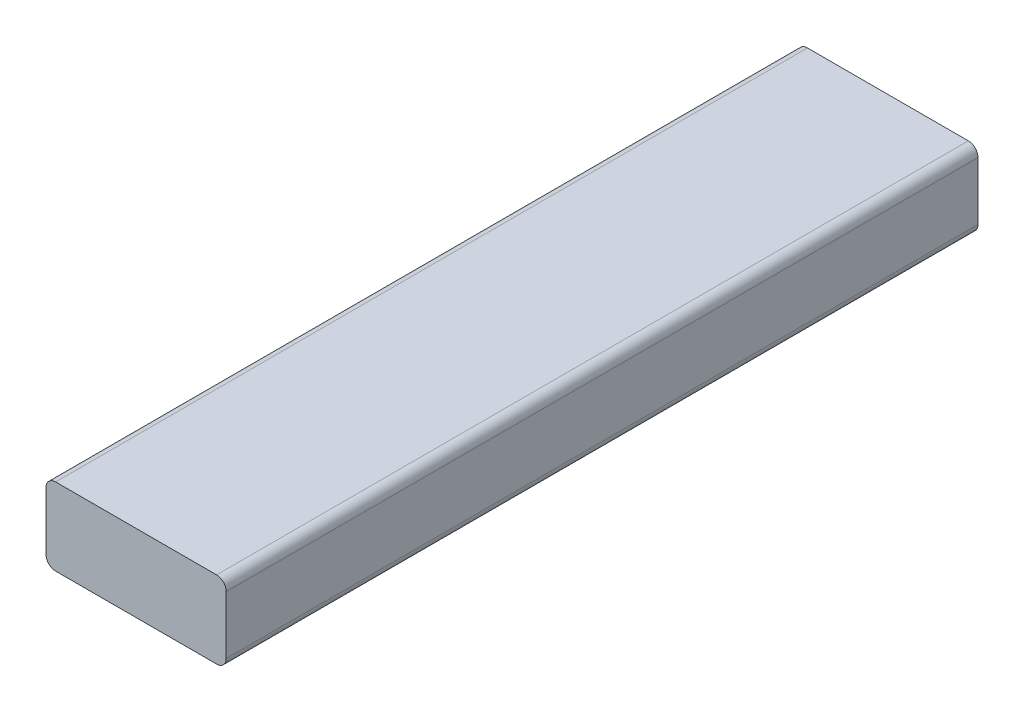
ISO-10303-21;
HEADER;
FILE_DESCRIPTION(('STEP AP214'),'2;1');
FILE_NAME('part.step','',(''),(''),'','','');
FILE_SCHEMA(('AUTOMOTIVE_DESIGN { 1 0 10303 214 1 1 1 1 }'));
ENDSEC;
DATA;
#1=APPLICATION_CONTEXT('core data for automotive mechanical design processes');
#2=APPLICATION_PROTOCOL_DEFINITION('international standard','automotive_design',2000,#1);
#3=PRODUCT_CONTEXT('',#1,'mechanical');
#4=PRODUCT('Part','Part','',(#3));
#5=PRODUCT_RELATED_PRODUCT_CATEGORY('part','',(#4));
#6=PRODUCT_DEFINITION_FORMATION('','',#4);
#7=PRODUCT_DEFINITION_CONTEXT('part definition',#1,'design');
#8=PRODUCT_DEFINITION('design','',#6,#7);
#9=PRODUCT_DEFINITION_SHAPE('','',#8);
#10=(LENGTH_UNIT() NAMED_UNIT(*) SI_UNIT(.MILLI.,.METRE.));
#11=(NAMED_UNIT(*) PLANE_ANGLE_UNIT() SI_UNIT($,.RADIAN.));
#12=(NAMED_UNIT(*) SI_UNIT($,.STERADIAN.) SOLID_ANGLE_UNIT());
#13=UNCERTAINTY_MEASURE_WITH_UNIT(LENGTH_MEASURE(1.E-05),#10,'distance_accuracy_value','');
#14=(GEOMETRIC_REPRESENTATION_CONTEXT(3) GLOBAL_UNCERTAINTY_ASSIGNED_CONTEXT((#13)) GLOBAL_UNIT_ASSIGNED_CONTEXT((#10,
#11,#12)) REPRESENTATION_CONTEXT('',''));
#15=CARTESIAN_POINT('',(0.,0.,0.));
#16=DIRECTION('',(0.,0.,1.));
#17=DIRECTION('',(1.,0.,0.));
#18=AXIS2_PLACEMENT_3D('',#15,#16,#17);
#19=CARTESIAN_POINT('',(458.932187925,38.1,467.496818444492));
#20=DIRECTION('',(1.,0.,0.));
#21=DIRECTION('',(0.,0.,-1.));
#22=AXIS2_PLACEMENT_3D('',#19,#20,#21);
#23=PLANE('',#22);
#24=DIRECTION('',(0.,-1.,0.));
#25=VECTOR('',#24,1.);
#26=CARTESIAN_POINT('',(458.932187925,38.1,370.77650000002));
#27=LINE('',#26,#25);
#28=CARTESIAN_POINT('',(458.932187925,33.3375,370.77650000002));
#29=VERTEX_POINT('',#28);
#30=CARTESIAN_POINT('',(458.932187925,4.7625,370.77650000002));
#31=VERTEX_POINT('',#30);
#32=EDGE_CURVE('E139',#29,#31,#27,.T.);
#33=ORIENTED_EDGE('',*,*,#32,.F.);
#34=DIRECTION('',(0.,0.,-1.));
#35=VECTOR('',#34,1.);
#36=CARTESIAN_POINT('',(458.932187925,33.3375,467.496818444492));
#37=LINE('',#36,#35);
#38=CARTESIAN_POINT('',(458.932187925,33.3375,0.));
#39=VERTEX_POINT('',#38);
#40=EDGE_CURVE('E13',#29,#39,#37,.T.);
#41=ORIENTED_EDGE('',*,*,#40,.T.);
#42=DIRECTION('',(0.,-1.,0.));
#43=VECTOR('',#42,1.);
#44=CARTESIAN_POINT('',(458.932187925,38.1,0.));
#45=LINE('',#44,#43);
#46=CARTESIAN_POINT('',(458.932187925,4.7625,0.));
#47=VERTEX_POINT('',#46);
#48=EDGE_CURVE('E187',#39,#47,#45,.T.);
#49=ORIENTED_EDGE('',*,*,#48,.T.);
#50=DIRECTION('',(0.,0.,-1.));
#51=VECTOR('',#50,1.);
#52=CARTESIAN_POINT('',(458.932187925,4.76249999999999,467.496818444492));
#53=LINE('',#52,#51);
#54=EDGE_CURVE('E57',#47,#31,#53,.F.);
#55=ORIENTED_EDGE('',*,*,#54,.T.);
#56=EDGE_LOOP('',(#33,#41,#49,#55));
#57=FACE_BOUND('',#56,.T.);
#58=ADVANCED_FACE('F48',(#57),#23,.F.);
#59=CARTESIAN_POINT('',(458.932187925,0.,467.496818444492));
#60=DIRECTION('',(0.,1.,0.));
#61=DIRECTION('',(-1.,0.,0.));
#62=AXIS2_PLACEMENT_3D('',#59,#60,#61);
#63=PLANE('',#62);
#64=DIRECTION('',(1.,0.,0.));
#65=VECTOR('',#64,1.);
#66=CARTESIAN_POINT('',(458.932187925,0.,0.));
#67=LINE('',#66,#65);
#68=CARTESIAN_POINT('',(463.694687925,0.,0.));
#69=VERTEX_POINT('',#68);
#70=CARTESIAN_POINT('',(543.069687925,0.,0.));
#71=VERTEX_POINT('',#70);
#72=EDGE_CURVE('E195',#69,#71,#67,.T.);
#73=ORIENTED_EDGE('',*,*,#72,.T.);
#74=DIRECTION('',(0.,0.,-1.));
#75=VECTOR('',#74,1.);
#76=CARTESIAN_POINT('',(543.069687925,0.,467.496818444492));
#77=LINE('',#76,#75);
#78=CARTESIAN_POINT('',(543.069687925,0.,370.77650000002));
#79=VERTEX_POINT('',#78);
#80=EDGE_CURVE('E64',#71,#79,#77,.F.);
#81=ORIENTED_EDGE('',*,*,#80,.T.);
#82=DIRECTION('',(1.,0.,0.));
#83=VECTOR('',#82,1.);
#84=CARTESIAN_POINT('',(458.932187925,0.,370.77650000002));
#85=LINE('',#84,#83);
#86=CARTESIAN_POINT('',(463.694687925,0.,370.77650000002));
#87=VERTEX_POINT('',#86);
#88=EDGE_CURVE('E190',#87,#79,#85,.T.);
#89=ORIENTED_EDGE('',*,*,#88,.F.);
#90=DIRECTION('',(0.,0.,-1.));
#91=VECTOR('',#90,1.);
#92=CARTESIAN_POINT('',(463.694687925,0.,467.496818444492));
#93=LINE('',#92,#91);
#94=EDGE_CURVE('E127',#87,#69,#93,.T.);
#95=ORIENTED_EDGE('',*,*,#94,.T.);
#96=EDGE_LOOP('',(#73,#81,#89,#95));
#97=FACE_BOUND('',#96,.T.);
#98=ADVANCED_FACE('F194',(#97),#63,.F.);
#99=CARTESIAN_POINT('',(547.832187925,38.1,467.496818444492));
#100=DIRECTION('',(-1.,0.,0.));
#101=DIRECTION('',(0.,0.,1.));
#102=AXIS2_PLACEMENT_3D('',#99,#100,#101);
#103=PLANE('',#102);
#104=DIRECTION('',(0.,1.,0.));
#105=VECTOR('',#104,1.);
#106=CARTESIAN_POINT('',(547.832187925,38.1,0.));
#107=LINE('',#106,#105);
#108=CARTESIAN_POINT('',(547.832187925,4.76250000000001,0.));
#109=VERTEX_POINT('',#108);
#110=CARTESIAN_POINT('',(547.832187925,33.3375,0.));
#111=VERTEX_POINT('',#110);
#112=EDGE_CURVE('E200',#109,#111,#107,.T.);
#113=ORIENTED_EDGE('',*,*,#112,.T.);
#114=DIRECTION('',(0.,0.,-1.));
#115=VECTOR('',#114,1.);
#116=CARTESIAN_POINT('',(547.832187925,33.3375,467.496818444492));
#117=LINE('',#116,#115);
#118=CARTESIAN_POINT('',(547.832187925,33.3375,370.77650000002));
#119=VERTEX_POINT('',#118);
#120=EDGE_CURVE('E165',#111,#119,#117,.F.);
#121=ORIENTED_EDGE('',*,*,#120,.T.);
#122=DIRECTION('',(0.,1.,0.));
#123=VECTOR('',#122,1.);
#124=CARTESIAN_POINT('',(547.832187925,38.1,370.77650000002));
#125=LINE('',#124,#123);
#126=CARTESIAN_POINT('',(547.832187925,4.7625,370.77650000002));
#127=VERTEX_POINT('',#126);
#128=EDGE_CURVE('E122',#127,#119,#125,.T.);
#129=ORIENTED_EDGE('',*,*,#128,.F.);
#130=DIRECTION('',(0.,0.,-1.));
#131=VECTOR('',#130,1.);
#132=CARTESIAN_POINT('',(547.832187925,4.7625,467.496818444492));
#133=LINE('',#132,#131);
#134=EDGE_CURVE('E161',#127,#109,#133,.T.);
#135=ORIENTED_EDGE('',*,*,#134,.T.);
#136=EDGE_LOOP('',(#113,#121,#129,#135));
#137=FACE_BOUND('',#136,.T.);
#138=ADVANCED_FACE('F219',(#137),#103,.F.);
#139=CARTESIAN_POINT('',(458.932187925,38.1,467.496818444492));
#140=DIRECTION('',(0.,-1.,0.));
#141=DIRECTION('',(0.,0.,-1.));
#142=AXIS2_PLACEMENT_3D('',#139,#140,#141);
#143=PLANE('',#142);
#144=DIRECTION('',(-1.,0.,0.));
#145=VECTOR('',#144,1.);
#146=CARTESIAN_POINT('',(458.932187925,38.1,370.77650000002));
#147=LINE('',#146,#145);
#148=CARTESIAN_POINT('',(543.069687925,38.1,370.77650000002));
#149=VERTEX_POINT('',#148);
#150=CARTESIAN_POINT('',(463.694687925,38.1,370.77650000002));
#151=VERTEX_POINT('',#150);
#152=EDGE_CURVE('E119',#149,#151,#147,.T.);
#153=ORIENTED_EDGE('',*,*,#152,.F.);
#154=DIRECTION('',(0.,0.,-1.));
#155=VECTOR('',#154,1.);
#156=CARTESIAN_POINT('',(543.069687925,38.1,467.496818444492));
#157=LINE('',#156,#155);
#158=CARTESIAN_POINT('',(543.069687925,38.1,0.));
#159=VERTEX_POINT('',#158);
#160=EDGE_CURVE('E134',#149,#159,#157,.T.);
#161=ORIENTED_EDGE('',*,*,#160,.T.);
#162=DIRECTION('',(-1.,0.,0.));
#163=VECTOR('',#162,1.);
#164=CARTESIAN_POINT('',(458.932187925,38.1,0.));
#165=LINE('',#164,#163);
#166=CARTESIAN_POINT('',(463.694687925,38.1,0.));
#167=VERTEX_POINT('',#166);
#168=EDGE_CURVE('E140',#159,#167,#165,.T.);
#169=ORIENTED_EDGE('',*,*,#168,.T.);
#170=DIRECTION('',(0.,0.,-1.));
#171=VECTOR('',#170,1.);
#172=CARTESIAN_POINT('',(463.694687925,38.1,467.496818444492));
#173=LINE('',#172,#171);
#174=EDGE_CURVE('E137',#167,#151,#173,.F.);
#175=ORIENTED_EDGE('',*,*,#174,.T.);
#176=EDGE_LOOP('',(#153,#161,#169,#175));
#177=FACE_BOUND('',#176,.T.);
#178=ADVANCED_FACE('F132',(#177),#143,.F.);
#179=CARTESIAN_POINT('',(0.,0.,0.));
#180=DIRECTION('',(0.,0.,1.));
#181=DIRECTION('',(1.,0.,0.));
#182=AXIS2_PLACEMENT_3D('',#179,#180,#181);
#183=PLANE('',#182);
#184=ORIENTED_EDGE('',*,*,#168,.F.);
#185=CARTESIAN_POINT('',(543.069687925,33.3375,0.));
#186=DIRECTION('',(0.,0.,1.));
#187=DIRECTION('',(1.,0.,0.));
#188=AXIS2_PLACEMENT_3D('',#185,#186,#187);
#189=CIRCLE('',#188,4.7625);
#190=EDGE_CURVE('E143',#159,#111,#189,.F.);
#191=ORIENTED_EDGE('',*,*,#190,.T.);
#192=ORIENTED_EDGE('',*,*,#112,.F.);
#193=CARTESIAN_POINT('',(543.069687925,4.7625,0.));
#194=DIRECTION('',(0.,0.,1.));
#195=DIRECTION('',(1.,0.,0.));
#196=AXIS2_PLACEMENT_3D('',#193,#194,#195);
#197=CIRCLE('',#196,4.7625);
#198=EDGE_CURVE('E156',#109,#71,#197,.F.);
#199=ORIENTED_EDGE('',*,*,#198,.T.);
#200=ORIENTED_EDGE('',*,*,#72,.F.);
#201=CARTESIAN_POINT('',(463.694687925,4.76249999999999,0.));
#202=DIRECTION('',(0.,0.,1.));
#203=DIRECTION('',(1.,0.,0.));
#204=AXIS2_PLACEMENT_3D('',#201,#202,#203);
#205=CIRCLE('',#204,4.7625);
#206=EDGE_CURVE('E145',#69,#47,#205,.F.);
#207=ORIENTED_EDGE('',*,*,#206,.T.);
#208=ORIENTED_EDGE('',*,*,#48,.F.);
#209=CARTESIAN_POINT('',(463.694687925,33.3375,0.));
#210=DIRECTION('',(0.,0.,1.));
#211=DIRECTION('',(1.,0.,0.));
#212=AXIS2_PLACEMENT_3D('',#209,#210,#211);
#213=CIRCLE('',#212,4.7625);
#214=EDGE_CURVE('E150',#39,#167,#213,.F.);
#215=ORIENTED_EDGE('',*,*,#214,.T.);
#216=EDGE_LOOP('',(#184,#191,#192,#199,#200,#207,#208,#215));
#217=FACE_BOUND('',#216,.T.);
#218=ADVANCED_FACE('F197',(#217),#183,.F.);
#219=CARTESIAN_POINT('',(458.932187925,1612.9,370.776500000021));
#220=DIRECTION('',(0.,0.,1.));
#221=DIRECTION('',(0.,-1.,0.));
#222=AXIS2_PLACEMENT_3D('',#219,#220,#221);
#223=PLANE('',#222);
#224=ORIENTED_EDGE('',*,*,#128,.T.);
#225=CARTESIAN_POINT('',(543.069687925,33.3375,370.77650000002));
#226=DIRECTION('',(0.,0.,1.));
#227=DIRECTION('',(0.,-1.,0.));
#228=AXIS2_PLACEMENT_3D('',#225,#226,#227);
#229=CIRCLE('',#228,4.7625);
#230=EDGE_CURVE('E116',#119,#149,#229,.T.);
#231=ORIENTED_EDGE('',*,*,#230,.T.);
#232=ORIENTED_EDGE('',*,*,#152,.T.);
#233=CARTESIAN_POINT('',(463.694687925,33.3375,370.77650000002));
#234=DIRECTION('',(0.,0.,1.));
#235=DIRECTION('',(0.,-1.,0.));
#236=AXIS2_PLACEMENT_3D('',#233,#234,#235);
#237=CIRCLE('',#236,4.7625);
#238=EDGE_CURVE('E170',#151,#29,#237,.T.);
#239=ORIENTED_EDGE('',*,*,#238,.T.);
#240=ORIENTED_EDGE('',*,*,#32,.T.);
#241=CARTESIAN_POINT('',(463.694687925,4.76249999999999,370.77650000002));
#242=DIRECTION('',(0.,0.,1.));
#243=DIRECTION('',(0.,-1.,0.));
#244=AXIS2_PLACEMENT_3D('',#241,#242,#243);
#245=CIRCLE('',#244,4.7625);
#246=EDGE_CURVE('E71',#31,#87,#245,.T.);
#247=ORIENTED_EDGE('',*,*,#246,.T.);
#248=ORIENTED_EDGE('',*,*,#88,.T.);
#249=CARTESIAN_POINT('',(543.069687925,4.7625,370.77650000002));
#250=DIRECTION('',(0.,0.,1.));
#251=DIRECTION('',(0.,-1.,0.));
#252=AXIS2_PLACEMENT_3D('',#249,#250,#251);
#253=CIRCLE('',#252,4.7625);
#254=EDGE_CURVE('E128',#79,#127,#253,.T.);
#255=ORIENTED_EDGE('',*,*,#254,.T.);
#256=EDGE_LOOP('',(#224,#231,#232,#239,#240,#247,#248,#255));
#257=FACE_BOUND('',#256,.T.);
#258=ADVANCED_FACE('F118',(#257),#223,.T.);
#259=CARTESIAN_POINT('',(543.069687925,33.3375,467.496818444492));
#260=DIRECTION('',(0.,0.,-1.));
#261=DIRECTION('',(-1.,0.,0.));
#262=AXIS2_PLACEMENT_3D('',#259,#260,#261);
#263=CYLINDRICAL_SURFACE('',#262,4.7625);
#264=ORIENTED_EDGE('',*,*,#230,.F.);
#265=ORIENTED_EDGE('',*,*,#120,.F.);
#266=ORIENTED_EDGE('',*,*,#190,.F.);
#267=ORIENTED_EDGE('',*,*,#160,.F.);
#268=EDGE_LOOP('',(#264,#265,#266,#267));
#269=FACE_BOUND('',#268,.T.);
#270=ADVANCED_FACE('F142',(#269),#263,.T.);
#271=CARTESIAN_POINT('',(543.069687925,4.7625,467.496818444492));
#272=DIRECTION('',(0.,0.,-1.));
#273=DIRECTION('',(-1.,0.,0.));
#274=AXIS2_PLACEMENT_3D('',#271,#272,#273);
#275=CYLINDRICAL_SURFACE('',#274,4.7625);
#276=ORIENTED_EDGE('',*,*,#254,.F.);
#277=ORIENTED_EDGE('',*,*,#80,.F.);
#278=ORIENTED_EDGE('',*,*,#198,.F.);
#279=ORIENTED_EDGE('',*,*,#134,.F.);
#280=EDGE_LOOP('',(#276,#277,#278,#279));
#281=FACE_BOUND('',#280,.T.);
#282=ADVANCED_FACE('F217',(#281),#275,.T.);
#283=CARTESIAN_POINT('',(463.694687925,33.3375,467.496818444492));
#284=DIRECTION('',(0.,0.,-1.));
#285=DIRECTION('',(-1.,0.,0.));
#286=AXIS2_PLACEMENT_3D('',#283,#284,#285);
#287=CYLINDRICAL_SURFACE('',#286,4.7625);
#288=ORIENTED_EDGE('',*,*,#238,.F.);
#289=ORIENTED_EDGE('',*,*,#174,.F.);
#290=ORIENTED_EDGE('',*,*,#214,.F.);
#291=ORIENTED_EDGE('',*,*,#40,.F.);
#292=EDGE_LOOP('',(#288,#289,#290,#291));
#293=FACE_BOUND('',#292,.T.);
#294=ADVANCED_FACE('F226',(#293),#287,.T.);
#295=CARTESIAN_POINT('',(463.694687925,4.76249999999999,467.496818444492));
#296=DIRECTION('',(0.,0.,-1.));
#297=DIRECTION('',(-1.,0.,0.));
#298=AXIS2_PLACEMENT_3D('',#295,#296,#297);
#299=CYLINDRICAL_SURFACE('',#298,4.7625);
#300=ORIENTED_EDGE('',*,*,#246,.F.);
#301=ORIENTED_EDGE('',*,*,#54,.F.);
#302=ORIENTED_EDGE('',*,*,#206,.F.);
#303=ORIENTED_EDGE('',*,*,#94,.F.);
#304=EDGE_LOOP('',(#300,#301,#302,#303));
#305=FACE_BOUND('',#304,.T.);
#306=ADVANCED_FACE('F50',(#305),#299,.T.);
#307=CLOSED_SHELL('',(#58,#98,#138,#178,#218,#258,#270,#282,#294,#306));
#308=MANIFOLD_SOLID_BREP('B2',#307);
#309=ADVANCED_BREP_SHAPE_REPRESENTATION('',(#18,#308),#14);
#310=SHAPE_DEFINITION_REPRESENTATION(#9,#309);
ENDSEC;
END-ISO-10303-21;
